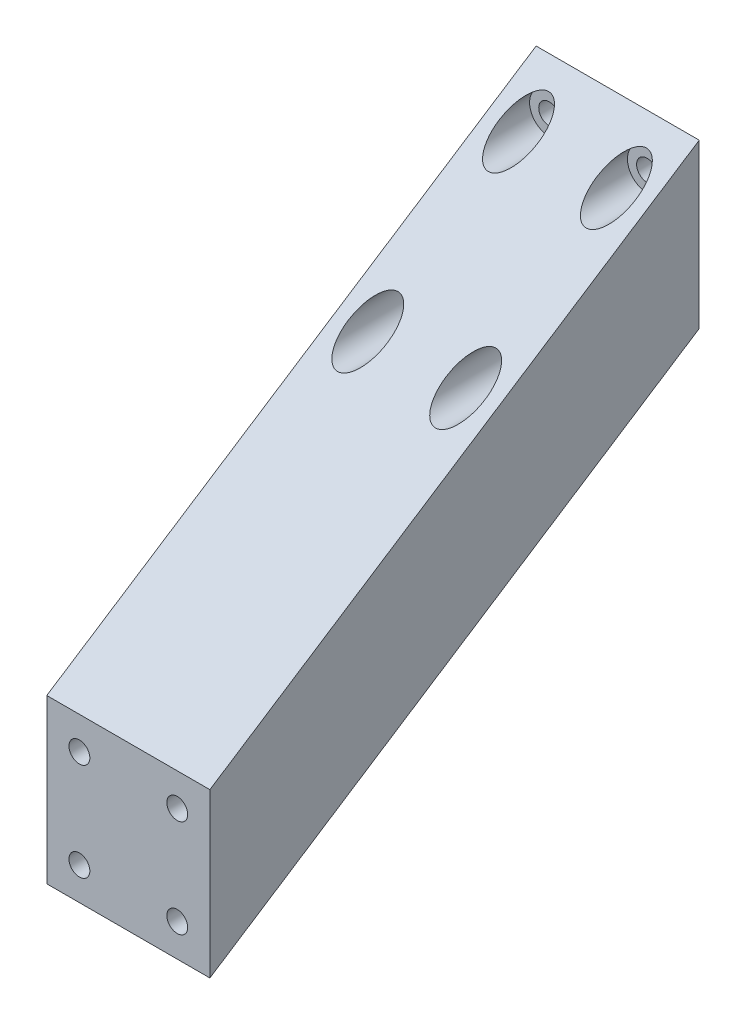
ISO-10303-21;
HEADER;
FILE_DESCRIPTION(('STEP AP214'),'2;1');
FILE_NAME('part.step','',(''),(''),'','','');
FILE_SCHEMA(('AUTOMOTIVE_DESIGN { 1 0 10303 214 1 1 1 1 }'));
ENDSEC;
DATA;
#1=APPLICATION_CONTEXT('core data for automotive mechanical design processes');
#2=APPLICATION_PROTOCOL_DEFINITION('international standard','automotive_design',2000,#1);
#3=PRODUCT_CONTEXT('',#1,'mechanical');
#4=PRODUCT('Part','Part','',(#3));
#5=PRODUCT_RELATED_PRODUCT_CATEGORY('part','',(#4));
#6=PRODUCT_DEFINITION_FORMATION('','',#4);
#7=PRODUCT_DEFINITION_CONTEXT('part definition',#1,'design');
#8=PRODUCT_DEFINITION('design','',#6,#7);
#9=PRODUCT_DEFINITION_SHAPE('','',#8);
#10=(LENGTH_UNIT() NAMED_UNIT(*) SI_UNIT(.MILLI.,.METRE.));
#11=(NAMED_UNIT(*) PLANE_ANGLE_UNIT() SI_UNIT($,.RADIAN.));
#12=(NAMED_UNIT(*) SI_UNIT($,.STERADIAN.) SOLID_ANGLE_UNIT());
#13=UNCERTAINTY_MEASURE_WITH_UNIT(LENGTH_MEASURE(1.E-05),#10,'distance_accuracy_value','');
#14=(GEOMETRIC_REPRESENTATION_CONTEXT(3) GLOBAL_UNCERTAINTY_ASSIGNED_CONTEXT((#13)) GLOBAL_UNIT_ASSIGNED_CONTEXT((#10,
#11,#12)) REPRESENTATION_CONTEXT('',''));
#15=CARTESIAN_POINT('',(0.,0.,0.));
#16=DIRECTION('',(0.,0.,1.));
#17=DIRECTION('',(1.,0.,0.));
#18=AXIS2_PLACEMENT_3D('',#15,#16,#17);
#19=CARTESIAN_POINT('',(25.,25.0000000000001,0.));
#20=DIRECTION('',(0.,0.,1.));
#21=DIRECTION('',(1.,0.,0.));
#22=AXIS2_PLACEMENT_3D('',#19,#20,#21);
#23=PLANE('',#22);
#24=CARTESIAN_POINT('',(20.,20.0000000000001,0.));
#25=DIRECTION('',(0.,0.,-1.));
#26=DIRECTION('',(-1.,0.,0.));
#27=AXIS2_PLACEMENT_3D('',#24,#25,#26);
#28=CIRCLE('',#27,1.6);
#29=CARTESIAN_POINT('',(18.4,20.0000000000001,0.));
#30=VERTEX_POINT('',#29);
#31=EDGE_CURVE('E143',#30,#30,#28,.T.);
#32=ORIENTED_EDGE('',*,*,#31,.F.);
#33=EDGE_LOOP('',(#32));
#34=FACE_BOUND('',#33,.T.);
#35=CARTESIAN_POINT('',(5.,5.00000000000011,0.));
#36=DIRECTION('',(0.,0.,-1.));
#37=DIRECTION('',(-1.,0.,0.));
#38=AXIS2_PLACEMENT_3D('',#35,#36,#37);
#39=CIRCLE('',#38,1.6);
#40=CARTESIAN_POINT('',(3.4,5.00000000000011,0.));
#41=VERTEX_POINT('',#40);
#42=EDGE_CURVE('E144',#41,#41,#39,.T.);
#43=ORIENTED_EDGE('',*,*,#42,.F.);
#44=EDGE_LOOP('',(#43));
#45=FACE_BOUND('',#44,.T.);
#46=CARTESIAN_POINT('',(20.,5.00000000000011,0.));
#47=DIRECTION('',(0.,0.,-1.));
#48=DIRECTION('',(-1.,0.,0.));
#49=AXIS2_PLACEMENT_3D('',#46,#47,#48);
#50=CIRCLE('',#49,1.6);
#51=CARTESIAN_POINT('',(18.4,5.00000000000011,0.));
#52=VERTEX_POINT('',#51);
#53=EDGE_CURVE('E154',#52,#52,#50,.T.);
#54=ORIENTED_EDGE('',*,*,#53,.F.);
#55=EDGE_LOOP('',(#54));
#56=FACE_BOUND('',#55,.T.);
#57=CARTESIAN_POINT('',(5.,20.0000000000001,0.));
#58=DIRECTION('',(0.,0.,-1.));
#59=DIRECTION('',(-1.,0.,0.));
#60=AXIS2_PLACEMENT_3D('',#57,#58,#59);
#61=CIRCLE('',#60,1.6);
#62=CARTESIAN_POINT('',(3.4,20.0000000000001,0.));
#63=VERTEX_POINT('',#62);
#64=EDGE_CURVE('E136',#63,#63,#61,.T.);
#65=ORIENTED_EDGE('',*,*,#64,.F.);
#66=EDGE_LOOP('',(#65));
#67=FACE_BOUND('',#66,.T.);
#68=DIRECTION('',(0.,1.,0.));
#69=VECTOR('',#68,1.);
#70=CARTESIAN_POINT('',(0.,25.0000000000001,0.));
#71=LINE('',#70,#69);
#72=CARTESIAN_POINT('',(0.,0.,0.));
#73=VERTEX_POINT('',#72);
#74=CARTESIAN_POINT('',(0.,25.0000000000001,0.));
#75=VERTEX_POINT('',#74);
#76=EDGE_CURVE('E96',#73,#75,#71,.T.);
#77=ORIENTED_EDGE('',*,*,#76,.T.);
#78=DIRECTION('',(-1.,0.,0.));
#79=VECTOR('',#78,1.);
#80=CARTESIAN_POINT('',(25.,25.0000000000001,0.));
#81=LINE('',#80,#79);
#82=CARTESIAN_POINT('',(25.,25.0000000000001,0.));
#83=VERTEX_POINT('',#82);
#84=EDGE_CURVE('E11',#83,#75,#81,.T.);
#85=ORIENTED_EDGE('',*,*,#84,.F.);
#86=DIRECTION('',(0.,1.,0.));
#87=VECTOR('',#86,1.);
#88=CARTESIAN_POINT('',(25.,25.0000000000001,0.));
#89=LINE('',#88,#87);
#90=CARTESIAN_POINT('',(25.,0.,0.));
#91=VERTEX_POINT('',#90);
#92=EDGE_CURVE('E84',#91,#83,#89,.T.);
#93=ORIENTED_EDGE('',*,*,#92,.F.);
#94=DIRECTION('',(-1.,0.,0.));
#95=VECTOR('',#94,1.);
#96=CARTESIAN_POINT('',(25.,0.,0.));
#97=LINE('',#96,#95);
#98=EDGE_CURVE('E92',#91,#73,#97,.T.);
#99=ORIENTED_EDGE('',*,*,#98,.T.);
#100=EDGE_LOOP('',(#77,#85,#93,#99));
#101=FACE_BOUND('',#100,.T.);
#102=ADVANCED_FACE('F33',(#34,#45,#56,#67,#101),#23,.F.);
#103=CARTESIAN_POINT('',(25.,-23.7055694898135,75.));
#104=DIRECTION('',(0.,-0.838670567945422,-0.54463903501503));
#105=DIRECTION('',(0.,0.54463903501503,-0.838670567945422));
#106=AXIS2_PLACEMENT_3D('',#103,#104,#105);
#107=PLANE('',#106);
#108=CARTESIAN_POINT('',(5.,20.0000000000001,7.69932481907287));
#109=DIRECTION('',(0.,-0.838670567945422,-0.54463903501503));
#110=DIRECTION('',(0.,0.54463903501503,-0.838670567945423));
#111=AXIS2_PLACEMENT_3D('',#108,#109,#110);
#112=ELLIPSE('',#111,5.50823537632997,3.);
#113=CARTESIAN_POINT('',(5.,23.0000000000001,3.07972992762915));
#114=VERTEX_POINT('',#113);
#115=EDGE_CURVE('E119',#114,#114,#112,.F.);
#116=ORIENTED_EDGE('',*,*,#115,.F.);
#117=EDGE_LOOP('',(#116));
#118=FACE_BOUND('',#117,.T.);
#119=CARTESIAN_POINT('',(5.,5.00000000000011,30.7972992762915));
#120=DIRECTION('',(0.,-0.838670567945422,-0.54463903501503));
#121=DIRECTION('',(0.,0.54463903501503,-0.838670567945423));
#122=AXIS2_PLACEMENT_3D('',#119,#120,#121);
#123=ELLIPSE('',#122,5.50823537632997,3.);
#124=CARTESIAN_POINT('',(5.,8.00000000000012,26.1777043848477));
#125=VERTEX_POINT('',#124);
#126=EDGE_CURVE('E126',#125,#125,#123,.F.);
#127=ORIENTED_EDGE('',*,*,#126,.F.);
#128=EDGE_LOOP('',(#127));
#129=FACE_BOUND('',#128,.T.);
#130=CARTESIAN_POINT('',(20.,5.00000000000011,30.7972992762915));
#131=DIRECTION('',(0.,-0.838670567945422,-0.54463903501503));
#132=DIRECTION('',(0.,0.54463903501503,-0.838670567945423));
#133=AXIS2_PLACEMENT_3D('',#130,#131,#132);
#134=ELLIPSE('',#133,5.50823537632997,3.);
#135=CARTESIAN_POINT('',(20.,8.00000000000012,26.1777043848477));
#136=VERTEX_POINT('',#135);
#137=EDGE_CURVE('E113',#136,#136,#134,.F.);
#138=ORIENTED_EDGE('',*,*,#137,.F.);
#139=EDGE_LOOP('',(#138));
#140=FACE_BOUND('',#139,.T.);
#141=CARTESIAN_POINT('',(20.,20.0000000000001,7.69932481907287));
#142=DIRECTION('',(0.,-0.838670567945422,-0.54463903501503));
#143=DIRECTION('',(0.,0.54463903501503,-0.838670567945423));
#144=AXIS2_PLACEMENT_3D('',#141,#142,#143);
#145=ELLIPSE('',#144,5.50823537632997,3.);
#146=CARTESIAN_POINT('',(20.,23.0000000000001,3.07972992762915));
#147=VERTEX_POINT('',#146);
#148=EDGE_CURVE('E99',#147,#147,#145,.F.);
#149=ORIENTED_EDGE('',*,*,#148,.F.);
#150=EDGE_LOOP('',(#149));
#151=FACE_BOUND('',#150,.T.);
#152=DIRECTION('',(0.,-0.54463903501503,0.838670567945422));
#153=VECTOR('',#152,1.);
#154=CARTESIAN_POINT('',(0.,-23.7055694898135,75.));
#155=LINE('',#154,#153);
#156=CARTESIAN_POINT('',(0.,-23.7055694898135,75.));
#157=VERTEX_POINT('',#156);
#158=EDGE_CURVE('E88',#75,#157,#155,.T.);
#159=ORIENTED_EDGE('',*,*,#158,.T.);
#160=DIRECTION('',(-1.,0.,0.));
#161=VECTOR('',#160,1.);
#162=CARTESIAN_POINT('',(25.,-23.7055694898135,75.));
#163=LINE('',#162,#161);
#164=CARTESIAN_POINT('',(25.,-23.7055694898135,75.));
#165=VERTEX_POINT('',#164);
#166=EDGE_CURVE('E41',#165,#157,#163,.T.);
#167=ORIENTED_EDGE('',*,*,#166,.F.);
#168=DIRECTION('',(0.,-0.54463903501503,0.838670567945422));
#169=VECTOR('',#168,1.);
#170=CARTESIAN_POINT('',(25.,-23.7055694898135,75.));
#171=LINE('',#170,#169);
#172=EDGE_CURVE('E79',#83,#165,#171,.T.);
#173=ORIENTED_EDGE('',*,*,#172,.F.);
#174=ORIENTED_EDGE('',*,*,#84,.T.);
#175=EDGE_LOOP('',(#159,#167,#173,#174));
#176=FACE_BOUND('',#175,.T.);
#177=ADVANCED_FACE('F87',(#118,#129,#140,#151,#176),#107,.F.);
#178=CARTESIAN_POINT('',(25.,-48.7055694898135,75.));
#179=DIRECTION('',(0.,0.,-1.));
#180=DIRECTION('',(-1.,0.,0.));
#181=AXIS2_PLACEMENT_3D('',#178,#179,#180);
#182=PLANE('',#181);
#183=CARTESIAN_POINT('',(5.,-43.7055694898135,75.));
#184=DIRECTION('',(0.,0.,1.));
#185=DIRECTION('',(1.,0.,0.));
#186=AXIS2_PLACEMENT_3D('',#183,#184,#185);
#187=CIRCLE('',#186,1.6);
#188=CARTESIAN_POINT('',(6.6,-43.7055694898135,75.));
#189=VERTEX_POINT('',#188);
#190=EDGE_CURVE('E192',#189,#189,#187,.T.);
#191=ORIENTED_EDGE('',*,*,#190,.F.);
#192=EDGE_LOOP('',(#191));
#193=FACE_BOUND('',#192,.T.);
#194=CARTESIAN_POINT('',(20.,-43.7055694898135,75.));
#195=DIRECTION('',(0.,0.,1.));
#196=DIRECTION('',(1.,0.,0.));
#197=AXIS2_PLACEMENT_3D('',#194,#195,#196);
#198=CIRCLE('',#197,1.6);
#199=CARTESIAN_POINT('',(21.6,-43.7055694898135,75.));
#200=VERTEX_POINT('',#199);
#201=EDGE_CURVE('E191',#200,#200,#198,.T.);
#202=ORIENTED_EDGE('',*,*,#201,.F.);
#203=EDGE_LOOP('',(#202));
#204=FACE_BOUND('',#203,.T.);
#205=CARTESIAN_POINT('',(20.,-28.7055694898135,75.));
#206=DIRECTION('',(0.,0.,1.));
#207=DIRECTION('',(1.,0.,0.));
#208=AXIS2_PLACEMENT_3D('',#205,#206,#207);
#209=CIRCLE('',#208,1.6);
#210=CARTESIAN_POINT('',(21.6,-28.7055694898135,75.));
#211=VERTEX_POINT('',#210);
#212=EDGE_CURVE('E198',#211,#211,#209,.T.);
#213=ORIENTED_EDGE('',*,*,#212,.F.);
#214=EDGE_LOOP('',(#213));
#215=FACE_BOUND('',#214,.T.);
#216=CARTESIAN_POINT('',(5.,-28.7055694898135,75.));
#217=DIRECTION('',(0.,0.,1.));
#218=DIRECTION('',(1.,0.,0.));
#219=AXIS2_PLACEMENT_3D('',#216,#217,#218);
#220=CIRCLE('',#219,1.6);
#221=CARTESIAN_POINT('',(6.6,-28.7055694898135,75.));
#222=VERTEX_POINT('',#221);
#223=EDGE_CURVE('E184',#222,#222,#220,.T.);
#224=ORIENTED_EDGE('',*,*,#223,.F.);
#225=EDGE_LOOP('',(#224));
#226=FACE_BOUND('',#225,.T.);
#227=DIRECTION('',(0.,-1.,0.));
#228=VECTOR('',#227,1.);
#229=CARTESIAN_POINT('',(0.,-48.7055694898135,75.));
#230=LINE('',#229,#228);
#231=CARTESIAN_POINT('',(0.,-48.7055694898135,75.));
#232=VERTEX_POINT('',#231);
#233=EDGE_CURVE('E66',#157,#232,#230,.T.);
#234=ORIENTED_EDGE('',*,*,#233,.T.);
#235=DIRECTION('',(-1.,0.,0.));
#236=VECTOR('',#235,1.);
#237=CARTESIAN_POINT('',(25.,-48.7055694898135,75.));
#238=LINE('',#237,#236);
#239=CARTESIAN_POINT('',(25.,-48.7055694898135,75.));
#240=VERTEX_POINT('',#239);
#241=EDGE_CURVE('E89',#240,#232,#238,.T.);
#242=ORIENTED_EDGE('',*,*,#241,.F.);
#243=DIRECTION('',(0.,-1.,0.));
#244=VECTOR('',#243,1.);
#245=CARTESIAN_POINT('',(25.,-48.7055694898135,75.));
#246=LINE('',#245,#244);
#247=EDGE_CURVE('E82',#165,#240,#246,.T.);
#248=ORIENTED_EDGE('',*,*,#247,.F.);
#249=ORIENTED_EDGE('',*,*,#166,.T.);
#250=EDGE_LOOP('',(#234,#242,#248,#249));
#251=FACE_BOUND('',#250,.T.);
#252=ADVANCED_FACE('F90',(#193,#204,#215,#226,#251),#182,.F.);
#253=CARTESIAN_POINT('',(25.,0.,0.));
#254=DIRECTION('',(0.,0.838670567945423,0.544639035015029));
#255=DIRECTION('',(0.,-0.544639035015029,0.838670567945423));
#256=AXIS2_PLACEMENT_3D('',#253,#254,#255);
#257=PLANE('',#256);
#258=CARTESIAN_POINT('',(20.,-28.7055694898135,44.2027007237085));
#259=DIRECTION('',(0.,0.838670567945423,0.544639035015029));
#260=DIRECTION('',(0.,-0.544639035015029,0.838670567945423));
#261=AXIS2_PLACEMENT_3D('',#258,#259,#260);
#262=ELLIPSE('',#261,5.50823537632998,3.);
#263=CARTESIAN_POINT('',(20.,-31.7055694898135,48.8222956151522));
#264=VERTEX_POINT('',#263);
#265=EDGE_CURVE('E167',#264,#264,#262,.F.);
#266=ORIENTED_EDGE('',*,*,#265,.F.);
#267=EDGE_LOOP('',(#266));
#268=FACE_BOUND('',#267,.T.);
#269=CARTESIAN_POINT('',(20.,-43.7055694898135,67.3006751809271));
#270=DIRECTION('',(0.,0.838670567945423,0.544639035015029));
#271=DIRECTION('',(0.,-0.544639035015029,0.838670567945423));
#272=AXIS2_PLACEMENT_3D('',#269,#270,#271);
#273=ELLIPSE('',#272,5.50823537632998,3.);
#274=CARTESIAN_POINT('',(20.,-46.7055694898135,71.9202700723709));
#275=VERTEX_POINT('',#274);
#276=EDGE_CURVE('E174',#275,#275,#273,.F.);
#277=ORIENTED_EDGE('',*,*,#276,.F.);
#278=EDGE_LOOP('',(#277));
#279=FACE_BOUND('',#278,.T.);
#280=CARTESIAN_POINT('',(5.,-43.7055694898135,67.3006751809271));
#281=DIRECTION('',(0.,0.838670567945423,0.544639035015029));
#282=DIRECTION('',(0.,-0.544639035015029,0.838670567945423));
#283=AXIS2_PLACEMENT_3D('',#280,#281,#282);
#284=ELLIPSE('',#283,5.50823537632998,3.00000000000001);
#285=CARTESIAN_POINT('',(5.,-46.7055694898135,71.9202700723709));
#286=VERTEX_POINT('',#285);
#287=EDGE_CURVE('E161',#286,#286,#284,.F.);
#288=ORIENTED_EDGE('',*,*,#287,.F.);
#289=EDGE_LOOP('',(#288));
#290=FACE_BOUND('',#289,.T.);
#291=CARTESIAN_POINT('',(5.,-28.7055694898135,44.2027007237085));
#292=DIRECTION('',(0.,0.838670567945423,0.544639035015029));
#293=DIRECTION('',(0.,-0.544639035015029,0.838670567945423));
#294=AXIS2_PLACEMENT_3D('',#291,#292,#293);
#295=ELLIPSE('',#294,5.50823537632998,3.00000000000001);
#296=CARTESIAN_POINT('',(5.,-31.7055694898135,48.8222956151522));
#297=VERTEX_POINT('',#296);
#298=EDGE_CURVE('E157',#297,#297,#295,.F.);
#299=ORIENTED_EDGE('',*,*,#298,.F.);
#300=EDGE_LOOP('',(#299));
#301=FACE_BOUND('',#300,.T.);
#302=DIRECTION('',(0.,0.544639035015029,-0.838670567945423));
#303=VECTOR('',#302,1.);
#304=CARTESIAN_POINT('',(0.,0.,0.));
#305=LINE('',#304,#303);
#306=EDGE_CURVE('E72',#232,#73,#305,.T.);
#307=ORIENTED_EDGE('',*,*,#306,.T.);
#308=ORIENTED_EDGE('',*,*,#98,.F.);
#309=DIRECTION('',(0.,0.544639035015029,-0.838670567945423));
#310=VECTOR('',#309,1.);
#311=CARTESIAN_POINT('',(25.,0.,0.));
#312=LINE('',#311,#310);
#313=EDGE_CURVE('E49',#240,#91,#312,.T.);
#314=ORIENTED_EDGE('',*,*,#313,.F.);
#315=ORIENTED_EDGE('',*,*,#241,.T.);
#316=EDGE_LOOP('',(#307,#308,#314,#315));
#317=FACE_BOUND('',#316,.T.);
#318=ADVANCED_FACE('F104',(#268,#279,#290,#301,#317),#257,.F.);
#319=CARTESIAN_POINT('',(25.,0.,0.));
#320=DIRECTION('',(-1.,0.,0.));
#321=DIRECTION('',(0.,0.,1.));
#322=AXIS2_PLACEMENT_3D('',#319,#320,#321);
#323=PLANE('',#322);
#324=ORIENTED_EDGE('',*,*,#92,.T.);
#325=ORIENTED_EDGE('',*,*,#172,.T.);
#326=ORIENTED_EDGE('',*,*,#247,.T.);
#327=ORIENTED_EDGE('',*,*,#313,.T.);
#328=EDGE_LOOP('',(#324,#325,#326,#327));
#329=FACE_BOUND('',#328,.T.);
#330=ADVANCED_FACE('F80',(#329),#323,.F.);
#331=CARTESIAN_POINT('',(0.,0.,0.));
#332=DIRECTION('',(-1.,0.,0.));
#333=DIRECTION('',(0.,0.,1.));
#334=AXIS2_PLACEMENT_3D('',#331,#332,#333);
#335=PLANE('',#334);
#336=ORIENTED_EDGE('',*,*,#76,.F.);
#337=ORIENTED_EDGE('',*,*,#306,.F.);
#338=ORIENTED_EDGE('',*,*,#233,.F.);
#339=ORIENTED_EDGE('',*,*,#158,.F.);
#340=EDGE_LOOP('',(#336,#337,#338,#339));
#341=FACE_BOUND('',#340,.T.);
#342=ADVANCED_FACE('F107',(#341),#335,.T.);
#343=CARTESIAN_POINT('',(20.,20.0000000000001,75.001));
#344=DIRECTION('',(0.,0.,-1.));
#345=DIRECTION('',(-1.,0.,0.));
#346=AXIS2_PLACEMENT_3D('',#343,#344,#345);
#347=CYLINDRICAL_SURFACE('',#346,3.);
#348=CARTESIAN_POINT('',(20.,20.0000000000001,3.));
#349=DIRECTION('',(0.,0.,-1.));
#350=DIRECTION('',(-1.,0.,0.));
#351=AXIS2_PLACEMENT_3D('',#348,#349,#350);
#352=CIRCLE('',#351,3.);
#353=CARTESIAN_POINT('',(17.,20.0000000000001,3.));
#354=VERTEX_POINT('',#353);
#355=EDGE_CURVE('E110',#354,#354,#352,.T.);
#356=ORIENTED_EDGE('',*,*,#355,.T.);
#357=EDGE_LOOP('',(#356));
#358=FACE_BOUND('',#357,.T.);
#359=ORIENTED_EDGE('',*,*,#148,.T.);
#360=EDGE_LOOP('',(#359));
#361=FACE_BOUND('',#360,.T.);
#362=ADVANCED_FACE('F286',(#358,#361),#347,.F.);
#363=CARTESIAN_POINT('',(20.,20.0000000000001,3.));
#364=DIRECTION('',(0.,0.,-1.));
#365=DIRECTION('',(-1.,0.,0.));
#366=AXIS2_PLACEMENT_3D('',#363,#364,#365);
#367=PLANE('',#366);
#368=CARTESIAN_POINT('',(20.,20.0000000000001,3.));
#369=DIRECTION('',(0.,0.,-1.));
#370=DIRECTION('',(-1.,0.,0.));
#371=AXIS2_PLACEMENT_3D('',#368,#369,#370);
#372=CIRCLE('',#371,1.6);
#373=CARTESIAN_POINT('',(18.4,20.0000000000001,3.));
#374=VERTEX_POINT('',#373);
#375=EDGE_CURVE('E139',#374,#374,#372,.F.);
#376=ORIENTED_EDGE('',*,*,#375,.F.);
#377=EDGE_LOOP('',(#376));
#378=FACE_BOUND('',#377,.T.);
#379=ORIENTED_EDGE('',*,*,#355,.F.);
#380=EDGE_LOOP('',(#379));
#381=FACE_BOUND('',#380,.T.);
#382=ADVANCED_FACE('F288',(#378,#381),#367,.F.);
#383=CARTESIAN_POINT('',(20.,5.00000000000011,75.001));
#384=DIRECTION('',(0.,0.,-1.));
#385=DIRECTION('',(-1.,0.,0.));
#386=AXIS2_PLACEMENT_3D('',#383,#384,#385);
#387=CYLINDRICAL_SURFACE('',#386,3.);
#388=CARTESIAN_POINT('',(20.,5.00000000000011,3.));
#389=DIRECTION('',(0.,0.,-1.));
#390=DIRECTION('',(-1.,0.,0.));
#391=AXIS2_PLACEMENT_3D('',#388,#389,#390);
#392=CIRCLE('',#391,3.);
#393=CARTESIAN_POINT('',(17.,5.00000000000011,3.));
#394=VERTEX_POINT('',#393);
#395=EDGE_CURVE('E129',#394,#394,#392,.T.);
#396=ORIENTED_EDGE('',*,*,#395,.T.);
#397=EDGE_LOOP('',(#396));
#398=FACE_BOUND('',#397,.T.);
#399=ORIENTED_EDGE('',*,*,#137,.T.);
#400=EDGE_LOOP('',(#399));
#401=FACE_BOUND('',#400,.T.);
#402=ADVANCED_FACE('F295',(#398,#401),#387,.F.);
#403=CARTESIAN_POINT('',(20.,5.00000000000011,3.));
#404=DIRECTION('',(0.,0.,-1.));
#405=DIRECTION('',(-1.,0.,0.));
#406=AXIS2_PLACEMENT_3D('',#403,#404,#405);
#407=PLANE('',#406);
#408=CARTESIAN_POINT('',(20.,5.00000000000011,3.));
#409=DIRECTION('',(0.,0.,-1.));
#410=DIRECTION('',(-1.,0.,0.));
#411=AXIS2_PLACEMENT_3D('',#408,#409,#410);
#412=CIRCLE('',#411,1.6);
#413=CARTESIAN_POINT('',(18.4,5.00000000000011,3.));
#414=VERTEX_POINT('',#413);
#415=EDGE_CURVE('E147',#414,#414,#412,.F.);
#416=ORIENTED_EDGE('',*,*,#415,.F.);
#417=EDGE_LOOP('',(#416));
#418=FACE_BOUND('',#417,.T.);
#419=ORIENTED_EDGE('',*,*,#395,.F.);
#420=EDGE_LOOP('',(#419));
#421=FACE_BOUND('',#420,.T.);
#422=ADVANCED_FACE('F302',(#418,#421),#407,.F.);
#423=CARTESIAN_POINT('',(5.,5.00000000000011,75.001));
#424=DIRECTION('',(0.,0.,-1.));
#425=DIRECTION('',(-1.,0.,0.));
#426=AXIS2_PLACEMENT_3D('',#423,#424,#425);
#427=CYLINDRICAL_SURFACE('',#426,3.);
#428=CARTESIAN_POINT('',(5.,5.00000000000011,3.));
#429=DIRECTION('',(0.,0.,-1.));
#430=DIRECTION('',(-1.,0.,0.));
#431=AXIS2_PLACEMENT_3D('',#428,#429,#430);
#432=CIRCLE('',#431,3.);
#433=CARTESIAN_POINT('',(2.,5.00000000000011,3.));
#434=VERTEX_POINT('',#433);
#435=EDGE_CURVE('E123',#434,#434,#432,.T.);
#436=ORIENTED_EDGE('',*,*,#435,.T.);
#437=EDGE_LOOP('',(#436));
#438=FACE_BOUND('',#437,.T.);
#439=ORIENTED_EDGE('',*,*,#126,.T.);
#440=EDGE_LOOP('',(#439));
#441=FACE_BOUND('',#440,.T.);
#442=ADVANCED_FACE('F299',(#438,#441),#427,.F.);
#443=CARTESIAN_POINT('',(5.,5.00000000000011,3.));
#444=DIRECTION('',(0.,0.,-1.));
#445=DIRECTION('',(-1.,0.,0.));
#446=AXIS2_PLACEMENT_3D('',#443,#444,#445);
#447=PLANE('',#446);
#448=CARTESIAN_POINT('',(5.,5.00000000000011,3.));
#449=DIRECTION('',(0.,0.,-1.));
#450=DIRECTION('',(-1.,0.,0.));
#451=AXIS2_PLACEMENT_3D('',#448,#449,#450);
#452=CIRCLE('',#451,1.6);
#453=CARTESIAN_POINT('',(3.4,5.00000000000011,3.));
#454=VERTEX_POINT('',#453);
#455=EDGE_CURVE('E140',#454,#454,#452,.F.);
#456=ORIENTED_EDGE('',*,*,#455,.F.);
#457=EDGE_LOOP('',(#456));
#458=FACE_BOUND('',#457,.T.);
#459=ORIENTED_EDGE('',*,*,#435,.F.);
#460=EDGE_LOOP('',(#459));
#461=FACE_BOUND('',#460,.T.);
#462=ADVANCED_FACE('F276',(#458,#461),#447,.F.);
#463=CARTESIAN_POINT('',(5.,20.0000000000001,75.001));
#464=DIRECTION('',(0.,0.,-1.));
#465=DIRECTION('',(-1.,0.,0.));
#466=AXIS2_PLACEMENT_3D('',#463,#464,#465);
#467=CYLINDRICAL_SURFACE('',#466,3.);
#468=CARTESIAN_POINT('',(5.,20.0000000000001,3.));
#469=DIRECTION('',(0.,0.,-1.));
#470=DIRECTION('',(-1.,0.,0.));
#471=AXIS2_PLACEMENT_3D('',#468,#469,#470);
#472=CIRCLE('',#471,3.);
#473=CARTESIAN_POINT('',(2.,20.0000000000001,3.));
#474=VERTEX_POINT('',#473);
#475=EDGE_CURVE('E116',#474,#474,#472,.T.);
#476=ORIENTED_EDGE('',*,*,#475,.T.);
#477=EDGE_LOOP('',(#476));
#478=FACE_BOUND('',#477,.T.);
#479=ORIENTED_EDGE('',*,*,#115,.T.);
#480=EDGE_LOOP('',(#479));
#481=FACE_BOUND('',#480,.T.);
#482=ADVANCED_FACE('F270',(#478,#481),#467,.F.);
#483=CARTESIAN_POINT('',(5.,20.0000000000001,3.));
#484=DIRECTION('',(0.,0.,-1.));
#485=DIRECTION('',(-1.,0.,0.));
#486=AXIS2_PLACEMENT_3D('',#483,#484,#485);
#487=PLANE('',#486);
#488=CARTESIAN_POINT('',(5.,20.0000000000001,3.));
#489=DIRECTION('',(0.,0.,-1.));
#490=DIRECTION('',(-1.,0.,0.));
#491=AXIS2_PLACEMENT_3D('',#488,#489,#490);
#492=CIRCLE('',#491,1.6);
#493=CARTESIAN_POINT('',(3.4,20.0000000000001,3.));
#494=VERTEX_POINT('',#493);
#495=EDGE_CURVE('E120',#494,#494,#492,.F.);
#496=ORIENTED_EDGE('',*,*,#495,.F.);
#497=EDGE_LOOP('',(#496));
#498=FACE_BOUND('',#497,.T.);
#499=ORIENTED_EDGE('',*,*,#475,.F.);
#500=EDGE_LOOP('',(#499));
#501=FACE_BOUND('',#500,.T.);
#502=ADVANCED_FACE('F264',(#498,#501),#487,.F.);
#503=CARTESIAN_POINT('',(5.,20.0000000000001,75.001));
#504=DIRECTION('',(0.,0.,-1.));
#505=DIRECTION('',(-1.,0.,0.));
#506=AXIS2_PLACEMENT_3D('',#503,#504,#505);
#507=CYLINDRICAL_SURFACE('',#506,1.6);
#508=ORIENTED_EDGE('',*,*,#64,.T.);
#509=EDGE_LOOP('',(#508));
#510=FACE_BOUND('',#509,.T.);
#511=ORIENTED_EDGE('',*,*,#495,.T.);
#512=EDGE_LOOP('',(#511));
#513=FACE_BOUND('',#512,.T.);
#514=ADVANCED_FACE('F260',(#510,#513),#507,.F.);
#515=CARTESIAN_POINT('',(5.,5.00000000000011,75.001));
#516=DIRECTION('',(0.,0.,-1.));
#517=DIRECTION('',(-1.,0.,0.));
#518=AXIS2_PLACEMENT_3D('',#515,#516,#517);
#519=CYLINDRICAL_SURFACE('',#518,1.6);
#520=ORIENTED_EDGE('',*,*,#42,.T.);
#521=EDGE_LOOP('',(#520));
#522=FACE_BOUND('',#521,.T.);
#523=ORIENTED_EDGE('',*,*,#455,.T.);
#524=EDGE_LOOP('',(#523));
#525=FACE_BOUND('',#524,.T.);
#526=ADVANCED_FACE('F263',(#522,#525),#519,.F.);
#527=CARTESIAN_POINT('',(20.,5.00000000000011,75.001));
#528=DIRECTION('',(0.,0.,-1.));
#529=DIRECTION('',(-1.,0.,0.));
#530=AXIS2_PLACEMENT_3D('',#527,#528,#529);
#531=CYLINDRICAL_SURFACE('',#530,1.6);
#532=ORIENTED_EDGE('',*,*,#53,.T.);
#533=EDGE_LOOP('',(#532));
#534=FACE_BOUND('',#533,.T.);
#535=ORIENTED_EDGE('',*,*,#415,.T.);
#536=EDGE_LOOP('',(#535));
#537=FACE_BOUND('',#536,.T.);
#538=ADVANCED_FACE('F315',(#534,#537),#531,.F.);
#539=CARTESIAN_POINT('',(20.,20.0000000000001,75.001));
#540=DIRECTION('',(0.,0.,-1.));
#541=DIRECTION('',(-1.,0.,0.));
#542=AXIS2_PLACEMENT_3D('',#539,#540,#541);
#543=CYLINDRICAL_SURFACE('',#542,1.6);
#544=ORIENTED_EDGE('',*,*,#31,.T.);
#545=EDGE_LOOP('',(#544));
#546=FACE_BOUND('',#545,.T.);
#547=ORIENTED_EDGE('',*,*,#375,.T.);
#548=EDGE_LOOP('',(#547));
#549=FACE_BOUND('',#548,.T.);
#550=ADVANCED_FACE('F232',(#546,#549),#543,.F.);
#551=CARTESIAN_POINT('',(5.,-28.7055694898135,-0.001000000000001));
#552=DIRECTION('',(0.,0.,1.));
#553=DIRECTION('',(1.,0.,0.));
#554=AXIS2_PLACEMENT_3D('',#551,#552,#553);
#555=CYLINDRICAL_SURFACE('',#554,3.00000000000001);
#556=CARTESIAN_POINT('',(5.,-28.7055694898135,72.));
#557=DIRECTION('',(0.,0.,1.));
#558=DIRECTION('',(1.,0.,0.));
#559=AXIS2_PLACEMENT_3D('',#556,#557,#558);
#560=CIRCLE('',#559,3.00000000000001);
#561=CARTESIAN_POINT('',(8.00000000000001,-28.7055694898135,72.));
#562=VERTEX_POINT('',#561);
#563=EDGE_CURVE('E158',#562,#562,#560,.T.);
#564=ORIENTED_EDGE('',*,*,#563,.T.);
#565=EDGE_LOOP('',(#564));
#566=FACE_BOUND('',#565,.T.);
#567=ORIENTED_EDGE('',*,*,#298,.T.);
#568=EDGE_LOOP('',(#567));
#569=FACE_BOUND('',#568,.T.);
#570=ADVANCED_FACE('F226',(#566,#569),#555,.F.);
#571=CARTESIAN_POINT('',(5.,-28.7055694898135,72.));
#572=DIRECTION('',(0.,0.,1.));
#573=DIRECTION('',(1.,0.,0.));
#574=AXIS2_PLACEMENT_3D('',#571,#572,#573);
#575=PLANE('',#574);
#576=CARTESIAN_POINT('',(5.,-28.7055694898135,72.));
#577=DIRECTION('',(0.,0.,1.));
#578=DIRECTION('',(1.,0.,0.));
#579=AXIS2_PLACEMENT_3D('',#576,#577,#578);
#580=CIRCLE('',#579,1.6);
#581=CARTESIAN_POINT('',(6.6,-28.7055694898135,72.));
#582=VERTEX_POINT('',#581);
#583=EDGE_CURVE('E168',#582,#582,#580,.F.);
#584=ORIENTED_EDGE('',*,*,#583,.F.);
#585=EDGE_LOOP('',(#584));
#586=FACE_BOUND('',#585,.T.);
#587=ORIENTED_EDGE('',*,*,#563,.F.);
#588=EDGE_LOOP('',(#587));
#589=FACE_BOUND('',#588,.T.);
#590=ADVANCED_FACE('F222',(#586,#589),#575,.F.);
#591=CARTESIAN_POINT('',(5.,-43.7055694898135,-0.001000000000001));
#592=DIRECTION('',(0.,0.,1.));
#593=DIRECTION('',(1.,0.,0.));
#594=AXIS2_PLACEMENT_3D('',#591,#592,#593);
#595=CYLINDRICAL_SURFACE('',#594,3.00000000000001);
#596=CARTESIAN_POINT('',(5.,-43.7055694898135,72.));
#597=DIRECTION('',(0.,0.,1.));
#598=DIRECTION('',(1.,0.,0.));
#599=AXIS2_PLACEMENT_3D('',#596,#597,#598);
#600=CIRCLE('',#599,3.00000000000001);
#601=CARTESIAN_POINT('',(8.00000000000001,-43.7055694898135,72.));
#602=VERTEX_POINT('',#601);
#603=EDGE_CURVE('E177',#602,#602,#600,.T.);
#604=ORIENTED_EDGE('',*,*,#603,.T.);
#605=EDGE_LOOP('',(#604));
#606=FACE_BOUND('',#605,.T.);
#607=ORIENTED_EDGE('',*,*,#287,.T.);
#608=EDGE_LOOP('',(#607));
#609=FACE_BOUND('',#608,.T.);
#610=ADVANCED_FACE('F225',(#606,#609),#595,.F.);
#611=CARTESIAN_POINT('',(5.,-43.7055694898135,72.));
#612=DIRECTION('',(0.,0.,1.));
#613=DIRECTION('',(1.,0.,0.));
#614=AXIS2_PLACEMENT_3D('',#611,#612,#613);
#615=PLANE('',#614);
#616=CARTESIAN_POINT('',(5.,-43.7055694898135,72.));
#617=DIRECTION('',(0.,0.,1.));
#618=DIRECTION('',(1.,0.,0.));
#619=AXIS2_PLACEMENT_3D('',#616,#617,#618);
#620=CIRCLE('',#619,1.6);
#621=CARTESIAN_POINT('',(6.6,-43.7055694898135,72.));
#622=VERTEX_POINT('',#621);
#623=EDGE_CURVE('E188',#622,#622,#620,.F.);
#624=ORIENTED_EDGE('',*,*,#623,.F.);
#625=EDGE_LOOP('',(#624));
#626=FACE_BOUND('',#625,.T.);
#627=ORIENTED_EDGE('',*,*,#603,.F.);
#628=EDGE_LOOP('',(#627));
#629=FACE_BOUND('',#628,.T.);
#630=ADVANCED_FACE('F335',(#626,#629),#615,.F.);
#631=CARTESIAN_POINT('',(20.,-43.7055694898135,-0.001000000000001));
#632=DIRECTION('',(0.,0.,1.));
#633=DIRECTION('',(1.,0.,0.));
#634=AXIS2_PLACEMENT_3D('',#631,#632,#633);
#635=CYLINDRICAL_SURFACE('',#634,3.);
#636=CARTESIAN_POINT('',(20.,-43.7055694898135,72.));
#637=DIRECTION('',(0.,0.,1.));
#638=DIRECTION('',(1.,0.,0.));
#639=AXIS2_PLACEMENT_3D('',#636,#637,#638);
#640=CIRCLE('',#639,3.);
#641=CARTESIAN_POINT('',(23.,-43.7055694898135,72.));
#642=VERTEX_POINT('',#641);
#643=EDGE_CURVE('E171',#642,#642,#640,.T.);
#644=ORIENTED_EDGE('',*,*,#643,.T.);
#645=EDGE_LOOP('',(#644));
#646=FACE_BOUND('',#645,.T.);
#647=ORIENTED_EDGE('',*,*,#276,.T.);
#648=EDGE_LOOP('',(#647));
#649=FACE_BOUND('',#648,.T.);
#650=ADVANCED_FACE('F332',(#646,#649),#635,.F.);
#651=CARTESIAN_POINT('',(20.,-43.7055694898135,72.));
#652=DIRECTION('',(0.,0.,1.));
#653=DIRECTION('',(1.,0.,0.));
#654=AXIS2_PLACEMENT_3D('',#651,#652,#653);
#655=PLANE('',#654);
#656=CARTESIAN_POINT('',(20.,-43.7055694898135,72.));
#657=DIRECTION('',(0.,0.,1.));
#658=DIRECTION('',(1.,0.,0.));
#659=AXIS2_PLACEMENT_3D('',#656,#657,#658);
#660=CIRCLE('',#659,1.6);
#661=CARTESIAN_POINT('',(21.6,-43.7055694898135,72.));
#662=VERTEX_POINT('',#661);
#663=EDGE_CURVE('E195',#662,#662,#660,.F.);
#664=ORIENTED_EDGE('',*,*,#663,.F.);
#665=EDGE_LOOP('',(#664));
#666=FACE_BOUND('',#665,.T.);
#667=ORIENTED_EDGE('',*,*,#643,.F.);
#668=EDGE_LOOP('',(#667));
#669=FACE_BOUND('',#668,.T.);
#670=ADVANCED_FACE('F327',(#666,#669),#655,.F.);
#671=CARTESIAN_POINT('',(20.,-28.7055694898135,-0.001000000000001));
#672=DIRECTION('',(0.,0.,1.));
#673=DIRECTION('',(1.,0.,0.));
#674=AXIS2_PLACEMENT_3D('',#671,#672,#673);
#675=CYLINDRICAL_SURFACE('',#674,3.);
#676=CARTESIAN_POINT('',(20.,-28.7055694898135,72.));
#677=DIRECTION('',(0.,0.,1.));
#678=DIRECTION('',(1.,0.,0.));
#679=AXIS2_PLACEMENT_3D('',#676,#677,#678);
#680=CIRCLE('',#679,3.);
#681=CARTESIAN_POINT('',(23.,-28.7055694898135,72.));
#682=VERTEX_POINT('',#681);
#683=EDGE_CURVE('E164',#682,#682,#680,.T.);
#684=ORIENTED_EDGE('',*,*,#683,.T.);
#685=EDGE_LOOP('',(#684));
#686=FACE_BOUND('',#685,.T.);
#687=ORIENTED_EDGE('',*,*,#265,.T.);
#688=EDGE_LOOP('',(#687));
#689=FACE_BOUND('',#688,.T.);
#690=ADVANCED_FACE('F323',(#686,#689),#675,.F.);
#691=CARTESIAN_POINT('',(20.,-28.7055694898135,72.));
#692=DIRECTION('',(0.,0.,1.));
#693=DIRECTION('',(1.,0.,0.));
#694=AXIS2_PLACEMENT_3D('',#691,#692,#693);
#695=PLANE('',#694);
#696=CARTESIAN_POINT('',(20.,-28.7055694898135,72.));
#697=DIRECTION('',(0.,0.,1.));
#698=DIRECTION('',(1.,0.,0.));
#699=AXIS2_PLACEMENT_3D('',#696,#697,#698);
#700=CIRCLE('',#699,1.6);
#701=CARTESIAN_POINT('',(21.6,-28.7055694898135,72.));
#702=VERTEX_POINT('',#701);
#703=EDGE_CURVE('E187',#702,#702,#700,.F.);
#704=ORIENTED_EDGE('',*,*,#703,.F.);
#705=EDGE_LOOP('',(#704));
#706=FACE_BOUND('',#705,.T.);
#707=ORIENTED_EDGE('',*,*,#683,.F.);
#708=EDGE_LOOP('',(#707));
#709=FACE_BOUND('',#708,.T.);
#710=ADVANCED_FACE('F326',(#706,#709),#695,.F.);
#711=CARTESIAN_POINT('',(20.,-28.7055694898135,-0.001000000000001));
#712=DIRECTION('',(0.,0.,1.));
#713=DIRECTION('',(1.,0.,0.));
#714=AXIS2_PLACEMENT_3D('',#711,#712,#713);
#715=CYLINDRICAL_SURFACE('',#714,1.6);
#716=ORIENTED_EDGE('',*,*,#212,.T.);
#717=EDGE_LOOP('',(#716));
#718=FACE_BOUND('',#717,.T.);
#719=ORIENTED_EDGE('',*,*,#703,.T.);
#720=EDGE_LOOP('',(#719));
#721=FACE_BOUND('',#720,.T.);
#722=ADVANCED_FACE('F206',(#718,#721),#715,.F.);
#723=CARTESIAN_POINT('',(20.,-43.7055694898135,-0.001000000000001));
#724=DIRECTION('',(0.,0.,1.));
#725=DIRECTION('',(1.,0.,0.));
#726=AXIS2_PLACEMENT_3D('',#723,#724,#725);
#727=CYLINDRICAL_SURFACE('',#726,1.6);
#728=ORIENTED_EDGE('',*,*,#201,.T.);
#729=EDGE_LOOP('',(#728));
#730=FACE_BOUND('',#729,.T.);
#731=ORIENTED_EDGE('',*,*,#663,.T.);
#732=EDGE_LOOP('',(#731));
#733=FACE_BOUND('',#732,.T.);
#734=ADVANCED_FACE('F348',(#730,#733),#727,.F.);
#735=CARTESIAN_POINT('',(5.,-43.7055694898135,-0.001000000000001));
#736=DIRECTION('',(0.,0.,1.));
#737=DIRECTION('',(1.,0.,0.));
#738=AXIS2_PLACEMENT_3D('',#735,#736,#737);
#739=CYLINDRICAL_SURFACE('',#738,1.6);
#740=ORIENTED_EDGE('',*,*,#190,.T.);
#741=EDGE_LOOP('',(#740));
#742=FACE_BOUND('',#741,.T.);
#743=ORIENTED_EDGE('',*,*,#623,.T.);
#744=EDGE_LOOP('',(#743));
#745=FACE_BOUND('',#744,.T.);
#746=ADVANCED_FACE('F218',(#742,#745),#739,.F.);
#747=CARTESIAN_POINT('',(5.,-28.7055694898135,-0.001000000000001));
#748=DIRECTION('',(0.,0.,1.));
#749=DIRECTION('',(1.,0.,0.));
#750=AXIS2_PLACEMENT_3D('',#747,#748,#749);
#751=CYLINDRICAL_SURFACE('',#750,1.6);
#752=ORIENTED_EDGE('',*,*,#223,.T.);
#753=EDGE_LOOP('',(#752));
#754=FACE_BOUND('',#753,.T.);
#755=ORIENTED_EDGE('',*,*,#583,.T.);
#756=EDGE_LOOP('',(#755));
#757=FACE_BOUND('',#756,.T.);
#758=ADVANCED_FACE('F215',(#754,#757),#751,.F.);
#759=CLOSED_SHELL('',(#102,#177,#252,#318,#330,#342,#362,#382,#402,#422,#442,#462,#482,#502,
#514,#526,#538,#550,#570,#590,#610,#630,#650,#670,#690,#710,#722,#734,#746,#758));
#760=MANIFOLD_SOLID_BREP('B2',#759);
#761=ADVANCED_BREP_SHAPE_REPRESENTATION('',(#18,#760),#14);
#762=SHAPE_DEFINITION_REPRESENTATION(#9,#761);
ENDSEC;
END-ISO-10303-21;
